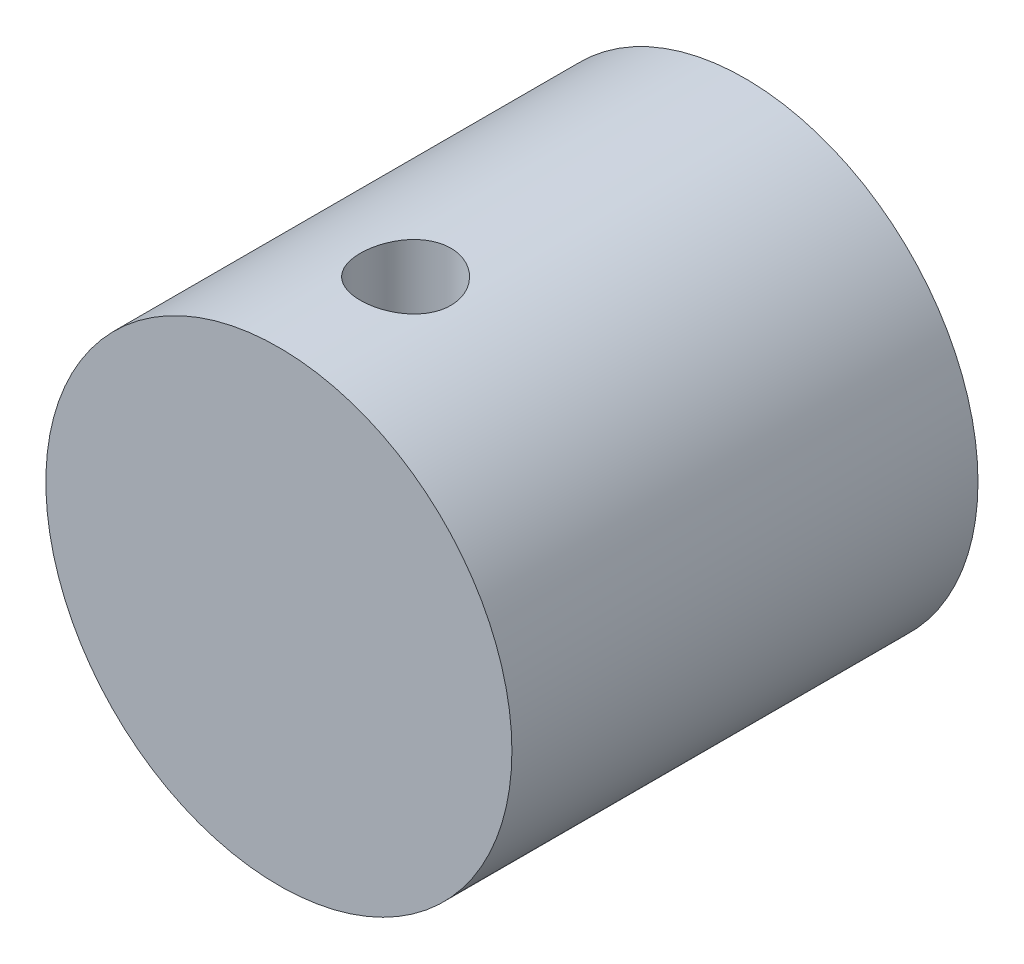
ISO-10303-21;
HEADER;
FILE_DESCRIPTION(('STEP AP214'),'2;1');
FILE_NAME('part.step','',(''),(''),'','','');
FILE_SCHEMA(('AUTOMOTIVE_DESIGN { 1 0 10303 214 1 1 1 1 }'));
ENDSEC;
DATA;
#1=APPLICATION_CONTEXT('core data for automotive mechanical design processes');
#2=APPLICATION_PROTOCOL_DEFINITION('international standard','automotive_design',2000,#1);
#3=PRODUCT_CONTEXT('',#1,'mechanical');
#4=PRODUCT('Part','Part','',(#3));
#5=PRODUCT_RELATED_PRODUCT_CATEGORY('part','',(#4));
#6=PRODUCT_DEFINITION_FORMATION('','',#4);
#7=PRODUCT_DEFINITION_CONTEXT('part definition',#1,'design');
#8=PRODUCT_DEFINITION('design','',#6,#7);
#9=PRODUCT_DEFINITION_SHAPE('','',#8);
#10=(LENGTH_UNIT() NAMED_UNIT(*) SI_UNIT(.MILLI.,.METRE.));
#11=(NAMED_UNIT(*) PLANE_ANGLE_UNIT() SI_UNIT($,.RADIAN.));
#12=(NAMED_UNIT(*) SI_UNIT($,.STERADIAN.) SOLID_ANGLE_UNIT());
#13=UNCERTAINTY_MEASURE_WITH_UNIT(LENGTH_MEASURE(1.E-05),#10,'distance_accuracy_value','');
#14=(GEOMETRIC_REPRESENTATION_CONTEXT(3) GLOBAL_UNCERTAINTY_ASSIGNED_CONTEXT((#13)) GLOBAL_UNIT_ASSIGNED_CONTEXT((#10,
#11,#12)) REPRESENTATION_CONTEXT('',''));
#15=CARTESIAN_POINT('',(0.,0.,0.));
#16=DIRECTION('',(0.,0.,1.));
#17=DIRECTION('',(1.,0.,0.));
#18=AXIS2_PLACEMENT_3D('',#15,#16,#17);
#19=CARTESIAN_POINT('',(0.,0.,10.3));
#20=DIRECTION('',(0.,0.,-1.));
#21=DIRECTION('',(-1.,0.,0.));
#22=AXIS2_PLACEMENT_3D('',#19,#20,#21);
#23=CYLINDRICAL_SURFACE('',#22,5.15);
#24=CARTESIAN_POINT('',(0.,0.,10.3));
#25=DIRECTION('',(0.,0.,1.));
#26=DIRECTION('',(1.,0.,0.));
#27=AXIS2_PLACEMENT_3D('',#24,#25,#26);
#28=CIRCLE('',#27,5.15);
#29=CARTESIAN_POINT('',(5.15,0.,10.3));
#30=VERTEX_POINT('',#29);
#31=EDGE_CURVE('E11',#30,#30,#28,.T.);
#32=ORIENTED_EDGE('',*,*,#31,.F.);
#33=EDGE_LOOP('',(#32));
#34=FACE_BOUND('',#33,.T.);
#35=CARTESIAN_POINT('',(0.,0.,0.));
#36=DIRECTION('',(0.,0.,1.));
#37=DIRECTION('',(1.,0.,0.));
#38=AXIS2_PLACEMENT_3D('',#35,#36,#37);
#39=CIRCLE('',#38,5.15);
#40=CARTESIAN_POINT('',(5.15,0.,0.));
#41=VERTEX_POINT('',#40);
#42=EDGE_CURVE('E47',#41,#41,#39,.T.);
#43=ORIENTED_EDGE('',*,*,#42,.T.);
#44=EDGE_LOOP('',(#43));
#45=FACE_BOUND('',#44,.T.);
#46=CARTESIAN_POINT('',(0.,-5.15,6.5));
#47=CARTESIAN_POINT('',(0.0556104964628396,-5.14999898190052,6.50000208434896));
#48=CARTESIAN_POINT('',(0.111247702930856,-5.14908999293089,6.50465446551632));
#49=CARTESIAN_POINT('',(0.220951758783998,-5.14555150299159,6.52312761442392));
#50=CARTESIAN_POINT('',(0.275017285978368,-5.14292059482662,6.53695588105468));
#51=CARTESIAN_POINT('',(0.37997578323427,-5.13623229243381,6.57333935812365));
#52=CARTESIAN_POINT('',(0.430871658915452,-5.1321762280001,6.59588643512261));
#53=CARTESIAN_POINT('',(0.528154027872828,-5.12307948464343,6.64904384205306));
#54=CARTESIAN_POINT('',(0.574540834884592,-5.11803887429754,6.67965361044161));
#55=CARTESIAN_POINT('',(0.662086219285484,-5.10745641185211,6.74848318701148));
#56=CARTESIAN_POINT('',(0.703178740900942,-5.1019094745584,6.78678623915098));
#57=CARTESIAN_POINT('',(0.778397365348587,-5.09097688033133,6.86973609395766));
#58=CARTESIAN_POINT('',(0.812522945149715,-5.08559123553259,6.9143833724802));
#59=CARTESIAN_POINT('',(0.873117111443148,-5.07554146343264,7.00922551883187));
#60=CARTESIAN_POINT('',(0.899517869184687,-5.07088388565872,7.0594644773704));
#61=CARTESIAN_POINT('',(0.943478589180766,-5.06288955065882,7.16377040073257));
#62=CARTESIAN_POINT('',(0.961039371971929,-5.05955267085028,7.21783700973772));
#63=CARTESIAN_POINT('',(0.986608367952575,-5.05462887116843,7.32755461516146));
#64=CARTESIAN_POINT('',(0.994732149292426,-5.05302079843882,7.38317771076811));
#65=CARTESIAN_POINT('',(1.0015553862018,-5.0516729666399,7.49501885846874));
#66=CARTESIAN_POINT('',(1.00025574908485,-5.05193302770134,7.55123685276373));
#67=CARTESIAN_POINT('',(0.988362608145267,-5.05427284209894,7.66183037099034));
#68=CARTESIAN_POINT('',(0.977901079462271,-5.05632675424321,7.71622071531434));
#69=CARTESIAN_POINT('',(0.94818921161925,-5.06198220506148,7.8224593294626));
#70=CARTESIAN_POINT('',(0.928938474567075,-5.06558381380008,7.87430748408289));
#71=CARTESIAN_POINT('',(0.882067189348623,-5.07395554807026,7.9743730289014));
#72=CARTESIAN_POINT('',(0.854393867853602,-5.07873300390317,8.02256506112486));
#73=CARTESIAN_POINT('',(0.791500234375541,-5.08891336117414,8.11367109584199));
#74=CARTESIAN_POINT('',(0.7562791029659,-5.09431633049166,8.15658452446818));
#75=CARTESIAN_POINT('',(0.678580695509088,-5.1052511933223,8.23667719639904));
#76=CARTESIAN_POINT('',(0.635990664121046,-5.1107837208603,8.27374705507016));
#77=CARTESIAN_POINT('',(0.545139360506461,-5.12127041630046,8.34023307644457));
#78=CARTESIAN_POINT('',(0.496878023331535,-5.12622457757782,8.36964915148353));
#79=CARTESIAN_POINT('',(0.395936074326391,-5.13500746263627,8.42001086984035));
#80=CARTESIAN_POINT('',(0.34324934329133,-5.1388345939636,8.44094454336522));
#81=CARTESIAN_POINT('',(0.235016207904449,-5.14492001967593,8.47363346562122));
#82=CARTESIAN_POINT('',(0.179470130502384,-5.14717849300182,8.48538976125857));
#83=CARTESIAN_POINT('',(0.068035550690152,-5.14984737512562,8.4992365838233));
#84=CARTESIAN_POINT('',(0.01216632387604,-5.15028641848596,8.50147688955231));
#85=CARTESIAN_POINT('',(-0.0991482698342314,-5.14934630026231,8.49663075046822));
#86=CARTESIAN_POINT('',(-0.154593658974932,-5.14796723476746,8.48954479855859));
#87=CARTESIAN_POINT('',(-0.263007334312659,-5.14356372917381,8.46637176937275));
#88=CARTESIAN_POINT('',(-0.315992556365129,-5.14055325120225,8.45036104025229));
#89=CARTESIAN_POINT('',(-0.418526467631764,-5.13322316276941,8.40987598858873));
#90=CARTESIAN_POINT('',(-0.468074910290786,-5.12890345850315,8.38540105957487));
#91=CARTESIAN_POINT('',(-0.562964016528673,-5.11936269234384,8.32835479894245));
#92=CARTESIAN_POINT('',(-0.608249069023954,-5.11413173598908,8.2956926547004));
#93=CARTESIAN_POINT('',(-0.692749211705869,-5.10337302178545,8.22332132603078));
#94=CARTESIAN_POINT('',(-0.731963690293686,-5.09784523410686,8.18361143241977));
#95=CARTESIAN_POINT('',(-0.80378337840433,-5.08702007185833,8.09759173646347));
#96=CARTESIAN_POINT('',(-0.836286047928825,-5.08172712299942,8.05119566970437));
#97=CARTESIAN_POINT('',(-0.89303687662492,-5.07206242697757,7.95351434947865));
#98=CARTESIAN_POINT('',(-0.917285355551817,-5.0676906441325,7.9022292855032));
#99=CARTESIAN_POINT('',(-0.956696923120668,-5.06039853406041,7.79647702310566));
#100=CARTESIAN_POINT('',(-0.971905622541762,-5.05747093308436,7.74202734808891));
#101=CARTESIAN_POINT('',(-0.992945386334747,-5.05338266698507,7.63128286222481));
#102=CARTESIAN_POINT('',(-0.998777594884867,-5.05222178627646,7.5749882773605));
#103=CARTESIAN_POINT('',(-1.00085838906425,-5.05180988181009,7.46318032771737));
#104=CARTESIAN_POINT('',(-0.997268866773889,-5.05252659524569,7.40767003078876));
#105=CARTESIAN_POINT('',(-0.980964036973828,-5.05571729704186,7.2980604014127));
#106=CARTESIAN_POINT('',(-0.968248793631758,-5.05819127304623,7.24396105904687));
#107=CARTESIAN_POINT('',(-0.934123842913833,-5.06460371472293,7.13880449307453));
#108=CARTESIAN_POINT('',(-0.912732890377885,-5.06853901980644,7.08774097803446));
#109=CARTESIAN_POINT('',(-0.861881887812275,-5.07743271247536,6.98990204707479));
#110=CARTESIAN_POINT('',(-0.832421211185022,-5.0823911794998,6.9431269645198));
#111=CARTESIAN_POINT('',(-0.765709413346429,-5.09287189788878,6.85438424742247));
#112=CARTESIAN_POINT('',(-0.728340944916081,-5.0984019147503,6.81250572939182));
#113=CARTESIAN_POINT('',(-0.647117761037652,-5.10934579699564,6.73555992350116));
#114=CARTESIAN_POINT('',(-0.603261557709797,-5.11475963540841,6.70049420234859));
#115=CARTESIAN_POINT('',(-0.509793927971242,-5.12492335049758,6.6378476516467));
#116=CARTESIAN_POINT('',(-0.460130489148442,-5.12966622820193,6.61034324671936));
#117=CARTESIAN_POINT('',(-0.356809787948316,-5.13788501851734,6.56411338424455));
#118=CARTESIAN_POINT('',(-0.303156250270127,-5.14136209529249,6.54537985551321));
#119=CARTESIAN_POINT('',(-0.20780355221289,-5.14596614909925,6.52093508052399));
#120=CARTESIAN_POINT('',(-0.166654305477659,-5.14747013802751,6.5130981456448));
#121=CARTESIAN_POINT('',(-0.0836750672468916,-5.14948743230361,6.50262989588826));
#122=CARTESIAN_POINT('',(-0.0418450953253914,-5.15000076608685,6.499998431595));
#123=CARTESIAN_POINT('',(0.,-5.15,6.5));
#124=B_SPLINE_CURVE_WITH_KNOTS('',3,(#46,#47,#48,#49,#50,#51,#52,#53,#54,#55,#56,#57,#58,#59,
#60,#61,#62,#63,#64,#65,#66,#67,#68,#69,#70,#71,#72,#73,#74,#75,#76,#77,#78,#79,#80,#81,#82,#83,
#84,#85,#86,#87,#88,#89,#90,#91,#92,#93,#94,#95,#96,#97,#98,#99,#100,#101,#102,#103,#104,#105,
#106,#107,#108,#109,#110,#111,#112,#113,#114,#115,#116,#117,#118,#119,#120,#121,#122,#123),
.UNSPECIFIED.,.T.,.F.,(4,2,2,2,2,2,2,2,2,2,2,2,2,2,2,2,2,2,2,2,2,2,2,2,2,2,2,2,2,2,2,2,2,2,2,2,
2,2,4),(0.,0.166678432161262,0.333493248460562,0.500152823654753,0.66680079456355,
0.835359828103869,1.00393151127138,1.1739417572092,1.3439362196897,1.51182617344204,
1.67969996248672,1.84519461838742,2.0106967670624,2.17725802859542,2.34383738199038,
2.51323703552496,2.68263862923104,2.85227844545233,3.02189890724086,3.18883946615073,
3.35577120241402,3.52129634278992,3.68683334571204,3.85429470530634,4.02177292535053,
4.19164626769177,4.36151302863856,4.53051527588566,4.69949689885284,4.86559402253893,
5.03168997832234,5.19742877149313,5.36318043759255,5.53158998989845,5.7000382248495,
5.87013117033436,6.04006728280724,6.16549099835167,6.29091111372747),.UNSPECIFIED.);
#125=CARTESIAN_POINT('',(0.,-5.15,6.5));
#126=VERTEX_POINT('',#125);
#127=EDGE_CURVE('E116',#126,#126,#124,.T.);
#128=ORIENTED_EDGE('',*,*,#127,.F.);
#129=EDGE_LOOP('',(#128));
#130=FACE_BOUND('',#129,.T.);
#131=CARTESIAN_POINT('',(0.,5.15,6.5));
#132=CARTESIAN_POINT('',(-0.0556104964628379,5.14999898190052,6.50000208434896));
#133=CARTESIAN_POINT('',(-0.111247702930854,5.14908999293089,6.50465446551632));
#134=CARTESIAN_POINT('',(-0.220951758783997,5.1455515029916,6.52312761442392));
#135=CARTESIAN_POINT('',(-0.275017285978366,5.14292059482662,6.53695588105468));
#136=CARTESIAN_POINT('',(-0.379975783234269,5.13623229243381,6.57333935812365));
#137=CARTESIAN_POINT('',(-0.43087165891545,5.1321762280001,6.59588643512261));
#138=CARTESIAN_POINT('',(-0.528154027872826,5.12307948464343,6.64904384205306));
#139=CARTESIAN_POINT('',(-0.57454083488459,5.11803887429754,6.67965361044161));
#140=CARTESIAN_POINT('',(-0.662086219285482,5.10745641185211,6.74848318701148));
#141=CARTESIAN_POINT('',(-0.70317874090094,5.1019094745584,6.78678623915098));
#142=CARTESIAN_POINT('',(-0.778397365348585,5.09097688033133,6.86973609395766));
#143=CARTESIAN_POINT('',(-0.812522945149713,5.08559123553259,6.9143833724802));
#144=CARTESIAN_POINT('',(-0.873117111443147,5.07554146343264,7.00922551883187));
#145=CARTESIAN_POINT('',(-0.899517869184685,5.07088388565872,7.0594644773704));
#146=CARTESIAN_POINT('',(-0.943478589180764,5.06288955065882,7.16377040073257));
#147=CARTESIAN_POINT('',(-0.961039371971928,5.05955267085028,7.21783700973772));
#148=CARTESIAN_POINT('',(-0.986608367952573,5.05462887116843,7.32755461516147));
#149=CARTESIAN_POINT('',(-0.994732149292425,5.05302079843882,7.38317771076812));
#150=CARTESIAN_POINT('',(-1.0015553862018,5.0516729666399,7.49501885846874));
#151=CARTESIAN_POINT('',(-1.00025574908485,5.05193302770134,7.55123685276373));
#152=CARTESIAN_POINT('',(-0.988362608145265,5.05427284209894,7.66183037099034));
#153=CARTESIAN_POINT('',(-0.977901079462269,5.05632675424321,7.71622071531434));
#154=CARTESIAN_POINT('',(-0.948189211619248,5.06198220506148,7.8224593294626));
#155=CARTESIAN_POINT('',(-0.928938474567074,5.06558381380008,7.87430748408289));
#156=CARTESIAN_POINT('',(-0.882067189348621,5.07395554807026,7.9743730289014));
#157=CARTESIAN_POINT('',(-0.8543938678536,5.07873300390317,8.02256506112486));
#158=CARTESIAN_POINT('',(-0.791500234375539,5.08891336117414,8.11367109584199));
#159=CARTESIAN_POINT('',(-0.756279102965899,5.09431633049166,8.15658452446818));
#160=CARTESIAN_POINT('',(-0.678580695509086,5.10525119332231,8.23667719639904));
#161=CARTESIAN_POINT('',(-0.635990664121045,5.1107837208603,8.27374705507016));
#162=CARTESIAN_POINT('',(-0.545139360506459,5.12127041630046,8.34023307644457));
#163=CARTESIAN_POINT('',(-0.496878023331533,5.12622457757782,8.36964915148353));
#164=CARTESIAN_POINT('',(-0.395936074326389,5.13500746263627,8.42001086984035));
#165=CARTESIAN_POINT('',(-0.343249343291329,5.1388345939636,8.44094454336522));
#166=CARTESIAN_POINT('',(-0.235016207904448,5.14492001967593,8.47363346562122));
#167=CARTESIAN_POINT('',(-0.179470130502383,5.14717849300182,8.48538976125857));
#168=CARTESIAN_POINT('',(-0.0680355506901505,5.14984737512562,8.4992365838233));
#169=CARTESIAN_POINT('',(-0.0121663238760385,5.15028641848596,8.50147688955231));
#170=CARTESIAN_POINT('',(0.0991482698342329,5.14934630026231,8.49663075046822));
#171=CARTESIAN_POINT('',(0.154593658974934,5.14796723476746,8.48954479855859));
#172=CARTESIAN_POINT('',(0.263007334312661,5.14356372917381,8.46637176937275));
#173=CARTESIAN_POINT('',(0.315992556365131,5.14055325120225,8.45036104025229));
#174=CARTESIAN_POINT('',(0.418526467631766,5.13322316276941,8.40987598858873));
#175=CARTESIAN_POINT('',(0.468074910290787,5.12890345850315,8.38540105957487));
#176=CARTESIAN_POINT('',(0.562964016528674,5.11936269234384,8.32835479894245));
#177=CARTESIAN_POINT('',(0.608249069023956,5.11413173598908,8.2956926547004));
#178=CARTESIAN_POINT('',(0.692749211705871,5.10337302178545,8.22332132603078));
#179=CARTESIAN_POINT('',(0.731963690293688,5.09784523410686,8.18361143241977));
#180=CARTESIAN_POINT('',(0.803783378404331,5.08702007185833,8.09759173646347));
#181=CARTESIAN_POINT('',(0.836286047928826,5.08172712299942,8.05119566970437));
#182=CARTESIAN_POINT('',(0.893036876624922,5.07206242697757,7.95351434947865));
#183=CARTESIAN_POINT('',(0.917285355551819,5.0676906441325,7.9022292855032));
#184=CARTESIAN_POINT('',(0.95669692312067,5.06039853406041,7.79647702310566));
#185=CARTESIAN_POINT('',(0.971905622541764,5.05747093308436,7.74202734808891));
#186=CARTESIAN_POINT('',(0.992945386334749,5.05338266698507,7.63128286222481));
#187=CARTESIAN_POINT('',(0.998777594884869,5.05222178627646,7.5749882773605));
#188=CARTESIAN_POINT('',(1.00085838906425,5.05180988181009,7.46318032771737));
#189=CARTESIAN_POINT('',(0.997268866773891,5.05252659524569,7.40767003078876));
#190=CARTESIAN_POINT('',(0.98096403697383,5.05571729704186,7.2980604014127));
#191=CARTESIAN_POINT('',(0.968248793631759,5.05819127304623,7.24396105904687));
#192=CARTESIAN_POINT('',(0.934123842913835,5.06460371472293,7.13880449307453));
#193=CARTESIAN_POINT('',(0.912732890377887,5.06853901980644,7.08774097803446));
#194=CARTESIAN_POINT('',(0.861881887812277,5.07743271247535,6.98990204707479));
#195=CARTESIAN_POINT('',(0.832421211185023,5.0823911794998,6.9431269645198));
#196=CARTESIAN_POINT('',(0.76570941334643,5.09287189788878,6.85438424742247));
#197=CARTESIAN_POINT('',(0.728340944916083,5.0984019147503,6.81250572939182));
#198=CARTESIAN_POINT('',(0.647117761037655,5.10934579699564,6.73555992350116));
#199=CARTESIAN_POINT('',(0.603261557709799,5.11475963540841,6.70049420234859));
#200=CARTESIAN_POINT('',(0.509793927971245,5.12492335049758,6.6378476516467));
#201=CARTESIAN_POINT('',(0.460130489148446,5.12966622820193,6.61034324671936));
#202=CARTESIAN_POINT('',(0.356809787948319,5.13788501851734,6.56411338424455));
#203=CARTESIAN_POINT('',(0.303156250270129,5.14136209529249,6.54537985551321));
#204=CARTESIAN_POINT('',(0.207803552212891,5.14596614909925,6.52093508052399));
#205=CARTESIAN_POINT('',(0.16665430547766,5.14747013802751,6.5130981456448));
#206=CARTESIAN_POINT('',(0.0836750672468932,5.14948743230361,6.50262989588826));
#207=CARTESIAN_POINT('',(0.0418450953253932,5.15000076608685,6.49999843159499));
#208=CARTESIAN_POINT('',(0.,5.15,6.5));
#209=B_SPLINE_CURVE_WITH_KNOTS('',3,(#131,#132,#133,#134,#135,#136,#137,#138,#139,#140,#141,
#142,#143,#144,#145,#146,#147,#148,#149,#150,#151,#152,#153,#154,#155,#156,#157,#158,#159,#160,
#161,#162,#163,#164,#165,#166,#167,#168,#169,#170,#171,#172,#173,#174,#175,#176,#177,#178,#179,
#180,#181,#182,#183,#184,#185,#186,#187,#188,#189,#190,#191,#192,#193,#194,#195,#196,#197,#198,
#199,#200,#201,#202,#203,#204,#205,#206,#207,#208),.UNSPECIFIED.,.T.,.F.,(4,2,2,2,2,2,2,2,2,2,2,
2,2,2,2,2,2,2,2,2,2,2,2,2,2,2,2,2,2,2,2,2,2,2,2,2,2,2,4),(0.,0.166678432161262,
0.333493248460562,0.500152823654753,0.66680079456355,0.835359828103869,1.00393151127138,
1.1739417572092,1.3439362196897,1.51182617344204,1.67969996248672,1.84519461838742,
2.0106967670624,2.17725802859542,2.34383738199038,2.51323703552496,2.68263862923104,
2.85227844545232,3.02189890724086,3.18883946615073,3.35577120241402,3.52129634278992,
3.68683334571204,3.85429470530634,4.02177292535053,4.19164626769177,4.36151302863856,
4.53051527588567,4.69949689885284,4.86559402253893,5.03168997832234,5.19742877149313,
5.36318043759255,5.53158998989844,5.7000382248495,5.87013117033436,6.04006728280724,
6.16549099835167,6.29091111372747),.UNSPECIFIED.);
#210=CARTESIAN_POINT('',(0.,5.15,6.5));
#211=VERTEX_POINT('',#210);
#212=EDGE_CURVE('E39',#211,#211,#209,.T.);
#213=ORIENTED_EDGE('',*,*,#212,.F.);
#214=EDGE_LOOP('',(#213));
#215=FACE_BOUND('',#214,.T.);
#216=ADVANCED_FACE('F35',(#34,#45,#130,#215),#23,.T.);
#217=CARTESIAN_POINT('',(0.,0.,10.3));
#218=DIRECTION('',(0.,0.,1.));
#219=DIRECTION('',(1.,0.,0.));
#220=AXIS2_PLACEMENT_3D('',#217,#218,#219);
#221=PLANE('',#220);
#222=ORIENTED_EDGE('',*,*,#31,.T.);
#223=EDGE_LOOP('',(#222));
#224=FACE_BOUND('',#223,.T.);
#225=ADVANCED_FACE('F132',(#224),#221,.T.);
#226=CARTESIAN_POINT('',(0.,0.,0.));
#227=DIRECTION('',(0.,0.,1.));
#228=DIRECTION('',(1.,0.,0.));
#229=AXIS2_PLACEMENT_3D('',#226,#227,#228);
#230=PLANE('',#229);
#231=DIRECTION('',(1.,0.,0.));
#232=VECTOR('',#231,1.);
#233=CARTESIAN_POINT('',(2.025,2.025,0.));
#234=LINE('',#233,#232);
#235=CARTESIAN_POINT('',(-2.025,2.025,0.));
#236=VERTEX_POINT('',#235);
#237=CARTESIAN_POINT('',(2.025,2.025,0.));
#238=VERTEX_POINT('',#237);
#239=EDGE_CURVE('E90',#236,#238,#234,.T.);
#240=ORIENTED_EDGE('',*,*,#239,.F.);
#241=DIRECTION('',(0.,1.,0.));
#242=VECTOR('',#241,1.);
#243=CARTESIAN_POINT('',(-2.025,2.025,0.));
#244=LINE('',#243,#242);
#245=CARTESIAN_POINT('',(-2.025,-2.025,0.));
#246=VERTEX_POINT('',#245);
#247=EDGE_CURVE('E55',#246,#236,#244,.T.);
#248=ORIENTED_EDGE('',*,*,#247,.F.);
#249=DIRECTION('',(-1.,0.,0.));
#250=VECTOR('',#249,1.);
#251=CARTESIAN_POINT('',(2.025,-2.025,0.));
#252=LINE('',#251,#250);
#253=CARTESIAN_POINT('',(2.025,-2.025,0.));
#254=VERTEX_POINT('',#253);
#255=EDGE_CURVE('E106',#254,#246,#252,.T.);
#256=ORIENTED_EDGE('',*,*,#255,.F.);
#257=DIRECTION('',(0.,-1.,0.));
#258=VECTOR('',#257,1.);
#259=CARTESIAN_POINT('',(2.025,2.025,0.));
#260=LINE('',#259,#258);
#261=EDGE_CURVE('E112',#238,#254,#260,.T.);
#262=ORIENTED_EDGE('',*,*,#261,.F.);
#263=EDGE_LOOP('',(#240,#248,#256,#262));
#264=FACE_BOUND('',#263,.T.);
#265=ORIENTED_EDGE('',*,*,#42,.F.);
#266=EDGE_LOOP('',(#265));
#267=FACE_BOUND('',#266,.T.);
#268=ADVANCED_FACE('F129',(#264,#267),#230,.F.);
#269=CARTESIAN_POINT('',(0.,10.,7.5));
#270=DIRECTION('',(0.,-1.,0.));
#271=DIRECTION('',(0.,0.,-1.));
#272=AXIS2_PLACEMENT_3D('',#269,#270,#271);
#273=CYLINDRICAL_SURFACE('',#272,1.);
#274=ORIENTED_EDGE('',*,*,#127,.T.);
#275=EDGE_LOOP('',(#274));
#276=FACE_BOUND('',#275,.T.);
#277=ORIENTED_EDGE('',*,*,#212,.T.);
#278=EDGE_LOOP('',(#277));
#279=FACE_BOUND('',#278,.T.);
#280=ADVANCED_FACE('F123',(#276,#279),#273,.F.);
#281=CARTESIAN_POINT('',(-2.025,2.025,5.));
#282=DIRECTION('',(-1.,0.,0.));
#283=DIRECTION('',(0.,-1.,0.));
#284=AXIS2_PLACEMENT_3D('',#281,#282,#283);
#285=PLANE('',#284);
#286=ORIENTED_EDGE('',*,*,#247,.T.);
#287=DIRECTION('',(0.,0.,-1.));
#288=VECTOR('',#287,1.);
#289=CARTESIAN_POINT('',(-2.025,2.025,5.));
#290=LINE('',#289,#288);
#291=CARTESIAN_POINT('',(-2.025,2.025,5.));
#292=VERTEX_POINT('',#291);
#293=EDGE_CURVE('E78',#292,#236,#290,.T.);
#294=ORIENTED_EDGE('',*,*,#293,.F.);
#295=DIRECTION('',(0.,1.,0.));
#296=VECTOR('',#295,1.);
#297=CARTESIAN_POINT('',(-2.025,2.025,5.));
#298=LINE('',#297,#296);
#299=CARTESIAN_POINT('',(-2.025,-2.025,5.));
#300=VERTEX_POINT('',#299);
#301=EDGE_CURVE('E104',#300,#292,#298,.T.);
#302=ORIENTED_EDGE('',*,*,#301,.F.);
#303=DIRECTION('',(0.,0.,-1.));
#304=VECTOR('',#303,1.);
#305=CARTESIAN_POINT('',(-2.025,-2.025,5.));
#306=LINE('',#305,#304);
#307=EDGE_CURVE('E63',#300,#246,#306,.T.);
#308=ORIENTED_EDGE('',*,*,#307,.T.);
#309=EDGE_LOOP('',(#286,#294,#302,#308));
#310=FACE_BOUND('',#309,.T.);
#311=ADVANCED_FACE('F128',(#310),#285,.F.);
#312=CARTESIAN_POINT('',(2.025,-2.025,5.));
#313=DIRECTION('',(0.,-1.,0.));
#314=DIRECTION('',(0.,0.,-1.));
#315=AXIS2_PLACEMENT_3D('',#312,#313,#314);
#316=PLANE('',#315);
#317=ORIENTED_EDGE('',*,*,#255,.T.);
#318=ORIENTED_EDGE('',*,*,#307,.F.);
#319=DIRECTION('',(-1.,0.,0.));
#320=VECTOR('',#319,1.);
#321=CARTESIAN_POINT('',(2.025,-2.025,5.));
#322=LINE('',#321,#320);
#323=CARTESIAN_POINT('',(2.025,-2.025,5.));
#324=VERTEX_POINT('',#323);
#325=EDGE_CURVE('E101',#324,#300,#322,.T.);
#326=ORIENTED_EDGE('',*,*,#325,.F.);
#327=DIRECTION('',(0.,0.,-1.));
#328=VECTOR('',#327,1.);
#329=CARTESIAN_POINT('',(2.025,-2.025,5.));
#330=LINE('',#329,#328);
#331=EDGE_CURVE('E94',#324,#254,#330,.T.);
#332=ORIENTED_EDGE('',*,*,#331,.T.);
#333=EDGE_LOOP('',(#317,#318,#326,#332));
#334=FACE_BOUND('',#333,.T.);
#335=ADVANCED_FACE('F179',(#334),#316,.F.);
#336=CARTESIAN_POINT('',(2.025,2.025,5.));
#337=DIRECTION('',(1.,0.,0.));
#338=DIRECTION('',(0.,1.,0.));
#339=AXIS2_PLACEMENT_3D('',#336,#337,#338);
#340=PLANE('',#339);
#341=ORIENTED_EDGE('',*,*,#261,.T.);
#342=ORIENTED_EDGE('',*,*,#331,.F.);
#343=DIRECTION('',(0.,-1.,0.));
#344=VECTOR('',#343,1.);
#345=CARTESIAN_POINT('',(2.025,2.025,5.));
#346=LINE('',#345,#344);
#347=CARTESIAN_POINT('',(2.025,2.025,5.));
#348=VERTEX_POINT('',#347);
#349=EDGE_CURVE('E97',#348,#324,#346,.T.);
#350=ORIENTED_EDGE('',*,*,#349,.F.);
#351=DIRECTION('',(0.,0.,-1.));
#352=VECTOR('',#351,1.);
#353=CARTESIAN_POINT('',(2.025,2.025,5.));
#354=LINE('',#353,#352);
#355=EDGE_CURVE('E83',#348,#238,#354,.T.);
#356=ORIENTED_EDGE('',*,*,#355,.T.);
#357=EDGE_LOOP('',(#341,#342,#350,#356));
#358=FACE_BOUND('',#357,.T.);
#359=ADVANCED_FACE('F98',(#358),#340,.F.);
#360=CARTESIAN_POINT('',(2.025,2.025,5.));
#361=DIRECTION('',(0.,1.,0.));
#362=DIRECTION('',(0.,0.,1.));
#363=AXIS2_PLACEMENT_3D('',#360,#361,#362);
#364=PLANE('',#363);
#365=ORIENTED_EDGE('',*,*,#239,.T.);
#366=ORIENTED_EDGE('',*,*,#355,.F.);
#367=DIRECTION('',(1.,0.,0.));
#368=VECTOR('',#367,1.);
#369=CARTESIAN_POINT('',(2.025,2.025,5.));
#370=LINE('',#369,#368);
#371=EDGE_CURVE('E87',#292,#348,#370,.T.);
#372=ORIENTED_EDGE('',*,*,#371,.F.);
#373=ORIENTED_EDGE('',*,*,#293,.T.);
#374=EDGE_LOOP('',(#365,#366,#372,#373));
#375=FACE_BOUND('',#374,.T.);
#376=ADVANCED_FACE('F85',(#375),#364,.F.);
#377=CARTESIAN_POINT('',(0.,0.,5.));
#378=DIRECTION('',(0.,0.,-1.));
#379=DIRECTION('',(-1.,0.,0.));
#380=AXIS2_PLACEMENT_3D('',#377,#378,#379);
#381=PLANE('',#380);
#382=ORIENTED_EDGE('',*,*,#301,.T.);
#383=ORIENTED_EDGE('',*,*,#371,.T.);
#384=ORIENTED_EDGE('',*,*,#349,.T.);
#385=ORIENTED_EDGE('',*,*,#325,.T.);
#386=EDGE_LOOP('',(#382,#383,#384,#385));
#387=FACE_BOUND('',#386,.T.);
#388=ADVANCED_FACE('F103',(#387),#381,.T.);
#389=CLOSED_SHELL('',(#216,#225,#268,#280,#311,#335,#359,#376,#388));
#390=MANIFOLD_SOLID_BREP('B2',#389);
#391=ADVANCED_BREP_SHAPE_REPRESENTATION('',(#18,#390),#14);
#392=SHAPE_DEFINITION_REPRESENTATION(#9,#391);
ENDSEC;
END-ISO-10303-21;
